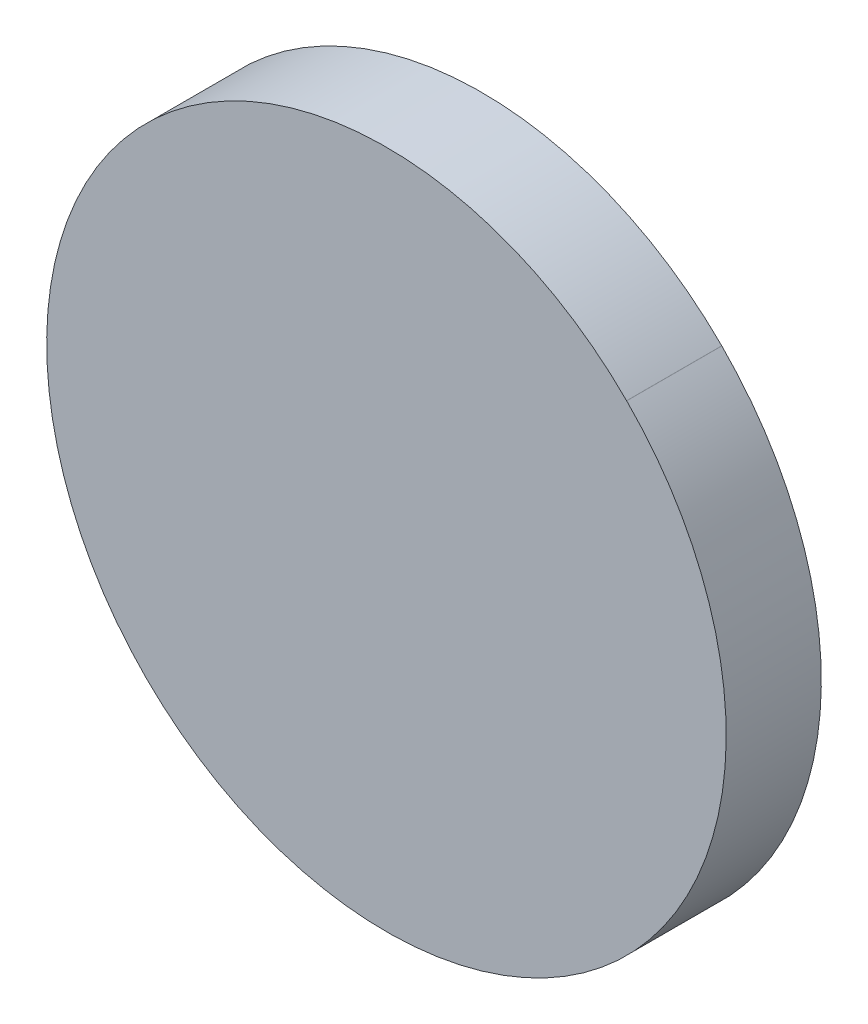
ISO-10303-21;
HEADER;
FILE_DESCRIPTION(('STEP AP214'),'2;1');
FILE_NAME('part.step','',(''),(''),'','','');
FILE_SCHEMA(('AUTOMOTIVE_DESIGN { 1 0 10303 214 1 1 1 1 }'));
ENDSEC;
DATA;
#1=APPLICATION_CONTEXT('core data for automotive mechanical design processes');
#2=APPLICATION_PROTOCOL_DEFINITION('international standard','automotive_design',2000,#1);
#3=PRODUCT_CONTEXT('',#1,'mechanical');
#4=PRODUCT('Part','Part','',(#3));
#5=PRODUCT_RELATED_PRODUCT_CATEGORY('part','',(#4));
#6=PRODUCT_DEFINITION_FORMATION('','',#4);
#7=PRODUCT_DEFINITION_CONTEXT('part definition',#1,'design');
#8=PRODUCT_DEFINITION('design','',#6,#7);
#9=PRODUCT_DEFINITION_SHAPE('','',#8);
#10=(LENGTH_UNIT() NAMED_UNIT(*) SI_UNIT(.MILLI.,.METRE.));
#11=(NAMED_UNIT(*) PLANE_ANGLE_UNIT() SI_UNIT($,.RADIAN.));
#12=(NAMED_UNIT(*) SI_UNIT($,.STERADIAN.) SOLID_ANGLE_UNIT());
#13=UNCERTAINTY_MEASURE_WITH_UNIT(LENGTH_MEASURE(1.E-05),#10,'distance_accuracy_value','');
#14=(GEOMETRIC_REPRESENTATION_CONTEXT(3) GLOBAL_UNCERTAINTY_ASSIGNED_CONTEXT((#13)) GLOBAL_UNIT_ASSIGNED_CONTEXT((#10,
#11,#12)) REPRESENTATION_CONTEXT('',''));
#15=CARTESIAN_POINT('',(0.,0.,0.));
#16=DIRECTION('',(0.,0.,1.));
#17=DIRECTION('',(1.,0.,0.));
#18=AXIS2_PLACEMENT_3D('',#15,#16,#17);
#19=CARTESIAN_POINT('',(99.2271955,84.0971521,0.));
#20=DIRECTION('',(0.707106780988741,0.707106781384355,0.));
#21=DIRECTION('',(0.707106781384355,-0.707106780988741,0.));
#22=AXIS2_PLACEMENT_3D('',#19,#20,#21);
#23=PLANE('',#22);
#24=DIRECTION('',(0.707106781384355,-0.707106780988741,0.));
#25=VECTOR('',#24,1.);
#26=CARTESIAN_POINT('',(99.2271955,84.0971521,0.03556));
#27=LINE('',#26,#25);
#28=CARTESIAN_POINT('',(99.2271955,84.0971521,0.03556));
#29=VERTEX_POINT('',#28);
#30=CARTESIAN_POINT('',(99.2272209,84.0971267,0.03556));
#31=VERTEX_POINT('',#30);
#32=EDGE_CURVE('E11',#29,#31,#27,.T.);
#33=ORIENTED_EDGE('',*,*,#32,.F.);
#34=DIRECTION('',(0.,0.,1.));
#35=VECTOR('',#34,1.);
#36=CARTESIAN_POINT('',(99.2271955,84.0971521,0.));
#37=LINE('',#36,#35);
#38=CARTESIAN_POINT('',(99.2271955,84.0971521,0.));
#39=VERTEX_POINT('',#38);
#40=EDGE_CURVE('E24',#39,#29,#37,.T.);
#41=ORIENTED_EDGE('',*,*,#40,.F.);
#42=DIRECTION('',(0.707106781384355,-0.707106780988741,0.));
#43=VECTOR('',#42,1.);
#44=CARTESIAN_POINT('',(99.2271955,84.0971521,0.));
#45=LINE('',#44,#43);
#46=CARTESIAN_POINT('',(99.2272209,84.0971267,0.));
#47=VERTEX_POINT('',#46);
#48=EDGE_CURVE('E75',#39,#47,#45,.T.);
#49=ORIENTED_EDGE('',*,*,#48,.T.);
#50=DIRECTION('',(0.,0.,1.));
#51=VECTOR('',#50,1.);
#52=CARTESIAN_POINT('',(99.2272209,84.0971267,0.));
#53=LINE('',#52,#51);
#54=EDGE_CURVE('E37',#47,#31,#53,.T.);
#55=ORIENTED_EDGE('',*,*,#54,.T.);
#56=EDGE_LOOP('',(#33,#41,#49,#55));
#57=FACE_BOUND('',#56,.T.);
#58=ADVANCED_FACE('F17',(#57),#23,.F.);
#59=CARTESIAN_POINT('',(99.3170226,84.1869284,0.));
#60=DIRECTION('',(0.,0.,-1.));
#61=DIRECTION('',(-0.707106781186604,-0.707106781186492,0.));
#62=AXIS2_PLACEMENT_3D('',#59,#60,#61);
#63=CYLINDRICAL_SURFACE('',#62,0.126998782064157);
#64=CARTESIAN_POINT('',(99.3170226,84.1869284,0.03556));
#65=DIRECTION('',(0.,0.,1.));
#66=DIRECTION('',(-0.707106781186604,-0.707106781186492,0.));
#67=AXIS2_PLACEMENT_3D('',#64,#65,#66);
#68=CIRCLE('',#67,0.126998782064157);
#69=CARTESIAN_POINT('',(99.4068243,84.2767301,0.03556));
#70=VERTEX_POINT('',#69);
#71=EDGE_CURVE('E83',#31,#70,#68,.T.);
#72=ORIENTED_EDGE('',*,*,#71,.F.);
#73=ORIENTED_EDGE('',*,*,#54,.F.);
#74=CARTESIAN_POINT('',(99.3170226,84.1869284,0.));
#75=DIRECTION('',(0.,0.,1.));
#76=DIRECTION('',(-0.707106781186604,-0.707106781186492,0.));
#77=AXIS2_PLACEMENT_3D('',#74,#75,#76);
#78=CIRCLE('',#77,0.126998782064157);
#79=CARTESIAN_POINT('',(99.4068243,84.2767301,0.));
#80=VERTEX_POINT('',#79);
#81=EDGE_CURVE('E81',#47,#80,#78,.T.);
#82=ORIENTED_EDGE('',*,*,#81,.T.);
#83=DIRECTION('',(0.,0.,1.));
#84=VECTOR('',#83,1.);
#85=CARTESIAN_POINT('',(99.4068243,84.2767301,0.));
#86=LINE('',#85,#84);
#87=EDGE_CURVE('E67',#80,#70,#86,.T.);
#88=ORIENTED_EDGE('',*,*,#87,.T.);
#89=EDGE_LOOP('',(#72,#73,#82,#88));
#90=FACE_BOUND('',#89,.T.);
#91=ADVANCED_FACE('F89',(#90),#63,.T.);
#92=CARTESIAN_POINT('',(99.4068243,84.2767301,0.));
#93=DIRECTION('',(-0.707106781186548,-0.707106781186548,0.));
#94=DIRECTION('',(-0.707106781186548,0.707106781186548,0.));
#95=AXIS2_PLACEMENT_3D('',#92,#93,#94);
#96=PLANE('',#95);
#97=DIRECTION('',(-0.707106781186548,0.707106781186548,0.));
#98=VECTOR('',#97,1.);
#99=CARTESIAN_POINT('',(99.4068243,84.2767301,0.03556));
#100=LINE('',#99,#98);
#101=CARTESIAN_POINT('',(99.4067989,84.2767555,0.03556));
#102=VERTEX_POINT('',#101);
#103=EDGE_CURVE('E71',#70,#102,#100,.T.);
#104=ORIENTED_EDGE('',*,*,#103,.F.);
#105=ORIENTED_EDGE('',*,*,#87,.F.);
#106=DIRECTION('',(-0.707106781186548,0.707106781186548,0.));
#107=VECTOR('',#106,1.);
#108=CARTESIAN_POINT('',(99.4068243,84.2767301,0.));
#109=LINE('',#108,#107);
#110=CARTESIAN_POINT('',(99.4067989,84.2767555,0.));
#111=VERTEX_POINT('',#110);
#112=EDGE_CURVE('E63',#80,#111,#109,.T.);
#113=ORIENTED_EDGE('',*,*,#112,.T.);
#114=DIRECTION('',(0.,0.,1.));
#115=VECTOR('',#114,1.);
#116=CARTESIAN_POINT('',(99.4067989,84.2767555,0.));
#117=LINE('',#116,#115);
#118=EDGE_CURVE('E53',#111,#102,#117,.T.);
#119=ORIENTED_EDGE('',*,*,#118,.T.);
#120=EDGE_LOOP('',(#104,#105,#113,#119));
#121=FACE_BOUND('',#120,.T.);
#122=ADVANCED_FACE('F66',(#121),#96,.F.);
#123=CARTESIAN_POINT('',(99.3169972,84.1869538,0.));
#124=DIRECTION('',(0.,0.,-1.));
#125=DIRECTION('',(0.707106781186548,0.707106781186548,0.));
#126=AXIS2_PLACEMENT_3D('',#123,#124,#125);
#127=CYLINDRICAL_SURFACE('',#126,0.126998782064163);
#128=CARTESIAN_POINT('',(99.3169972,84.1869538,0.03556));
#129=DIRECTION('',(0.,0.,1.));
#130=DIRECTION('',(0.707106781186548,0.707106781186548,0.));
#131=AXIS2_PLACEMENT_3D('',#128,#129,#130);
#132=CIRCLE('',#131,0.126998782064163);
#133=EDGE_CURVE('E59',#102,#29,#132,.T.);
#134=ORIENTED_EDGE('',*,*,#133,.F.);
#135=ORIENTED_EDGE('',*,*,#118,.F.);
#136=CARTESIAN_POINT('',(99.3169972,84.1869538,0.));
#137=DIRECTION('',(0.,0.,1.));
#138=DIRECTION('',(0.707106781186548,0.707106781186548,0.));
#139=AXIS2_PLACEMENT_3D('',#136,#137,#138);
#140=CIRCLE('',#139,0.126998782064163);
#141=EDGE_CURVE('E57',#111,#39,#140,.T.);
#142=ORIENTED_EDGE('',*,*,#141,.T.);
#143=ORIENTED_EDGE('',*,*,#40,.T.);
#144=EDGE_LOOP('',(#134,#135,#142,#143));
#145=FACE_BOUND('',#144,.T.);
#146=ADVANCED_FACE('F55',(#145),#127,.T.);
#147=CARTESIAN_POINT('',(99.2271955,84.0971521,0.));
#148=DIRECTION('',(0.,0.,-1.));
#149=DIRECTION('',(-1.,0.,0.));
#150=AXIS2_PLACEMENT_3D('',#147,#148,#149);
#151=PLANE('',#150);
#152=ORIENTED_EDGE('',*,*,#141,.F.);
#153=ORIENTED_EDGE('',*,*,#112,.F.);
#154=ORIENTED_EDGE('',*,*,#81,.F.);
#155=ORIENTED_EDGE('',*,*,#48,.F.);
#156=EDGE_LOOP('',(#152,#153,#154,#155));
#157=FACE_BOUND('',#156,.T.);
#158=ADVANCED_FACE('F74',(#157),#151,.T.);
#159=CARTESIAN_POINT('',(99.2271955,84.0971521,0.03556));
#160=DIRECTION('',(0.,0.,-1.));
#161=DIRECTION('',(-1.,0.,0.));
#162=AXIS2_PLACEMENT_3D('',#159,#160,#161);
#163=PLANE('',#162);
#164=ORIENTED_EDGE('',*,*,#32,.T.);
#165=ORIENTED_EDGE('',*,*,#71,.T.);
#166=ORIENTED_EDGE('',*,*,#103,.T.);
#167=ORIENTED_EDGE('',*,*,#133,.T.);
#168=EDGE_LOOP('',(#164,#165,#166,#167));
#169=FACE_BOUND('',#168,.T.);
#170=ADVANCED_FACE('F91',(#169),#163,.F.);
#171=CLOSED_SHELL('',(#58,#91,#122,#146,#158,#170));
#172=MANIFOLD_SOLID_BREP('B1',#171);
#173=ADVANCED_BREP_SHAPE_REPRESENTATION('',(#18,#172),#14);
#174=SHAPE_DEFINITION_REPRESENTATION(#9,#173);
ENDSEC;
END-ISO-10303-21;
